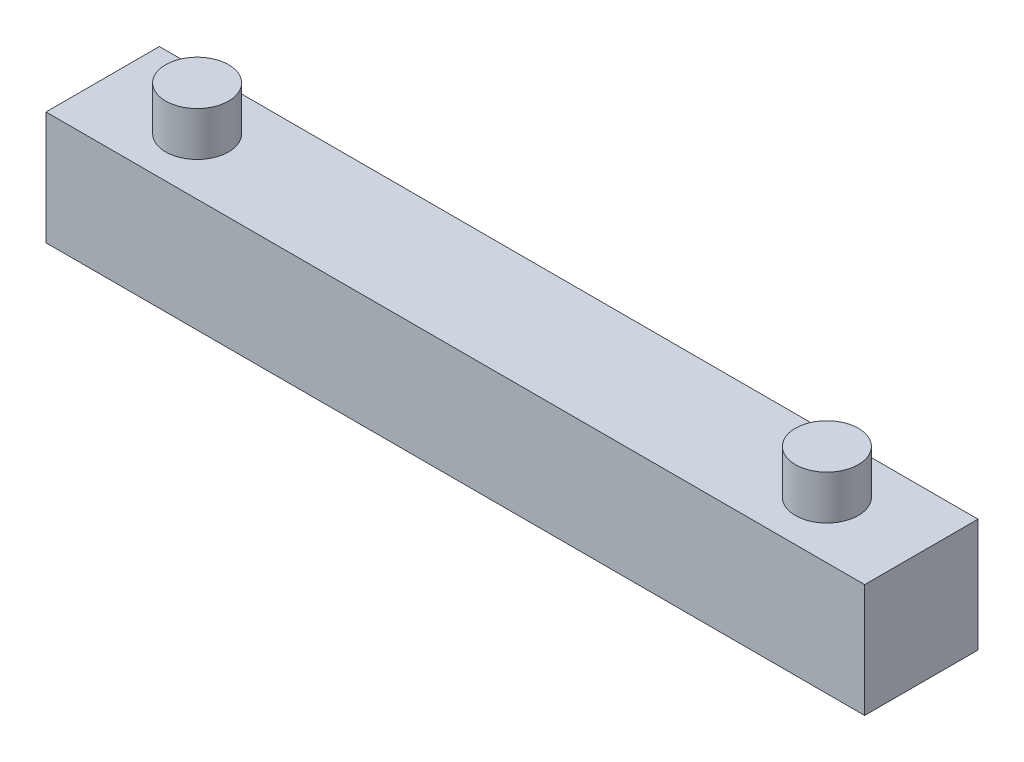
ISO-10303-21;
HEADER;
FILE_DESCRIPTION(('STEP AP214'),'2;1');
FILE_NAME('part.step','',(''),(''),'','','');
FILE_SCHEMA(('AUTOMOTIVE_DESIGN { 1 0 10303 214 1 1 1 1 }'));
ENDSEC;
DATA;
#1=APPLICATION_CONTEXT('core data for automotive mechanical design processes');
#2=APPLICATION_PROTOCOL_DEFINITION('international standard','automotive_design',2000,#1);
#3=PRODUCT_CONTEXT('',#1,'mechanical');
#4=PRODUCT('Part','Part','',(#3));
#5=PRODUCT_RELATED_PRODUCT_CATEGORY('part','',(#4));
#6=PRODUCT_DEFINITION_FORMATION('','',#4);
#7=PRODUCT_DEFINITION_CONTEXT('part definition',#1,'design');
#8=PRODUCT_DEFINITION('design','',#6,#7);
#9=PRODUCT_DEFINITION_SHAPE('','',#8);
#10=(LENGTH_UNIT() NAMED_UNIT(*) SI_UNIT(.MILLI.,.METRE.));
#11=(NAMED_UNIT(*) PLANE_ANGLE_UNIT() SI_UNIT($,.RADIAN.));
#12=(NAMED_UNIT(*) SI_UNIT($,.STERADIAN.) SOLID_ANGLE_UNIT());
#13=UNCERTAINTY_MEASURE_WITH_UNIT(LENGTH_MEASURE(1.E-05),#10,'distance_accuracy_value','');
#14=(GEOMETRIC_REPRESENTATION_CONTEXT(3) GLOBAL_UNCERTAINTY_ASSIGNED_CONTEXT((#13)) GLOBAL_UNIT_ASSIGNED_CONTEXT((#10,
#11,#12)) REPRESENTATION_CONTEXT('',''));
#15=CARTESIAN_POINT('',(0.,0.,0.));
#16=DIRECTION('',(0.,0.,1.));
#17=DIRECTION('',(1.,0.,0.));
#18=AXIS2_PLACEMENT_3D('',#15,#16,#17);
#19=CARTESIAN_POINT('',(-32.5,9.,-4.5));
#20=DIRECTION('',(1.,0.,0.));
#21=DIRECTION('',(0.,0.,-1.));
#22=AXIS2_PLACEMENT_3D('',#19,#20,#21);
#23=PLANE('',#22);
#24=DIRECTION('',(0.,0.,1.));
#25=VECTOR('',#24,1.);
#26=CARTESIAN_POINT('',(-32.5,0.,-4.5));
#27=LINE('',#26,#25);
#28=CARTESIAN_POINT('',(-32.5,0.,-4.5));
#29=VERTEX_POINT('',#28);
#30=CARTESIAN_POINT('',(-32.5,0.,4.5));
#31=VERTEX_POINT('',#30);
#32=EDGE_CURVE('E100',#29,#31,#27,.T.);
#33=ORIENTED_EDGE('',*,*,#32,.T.);
#34=DIRECTION('',(0.,-1.,0.));
#35=VECTOR('',#34,1.);
#36=CARTESIAN_POINT('',(-32.5,9.,4.5));
#37=LINE('',#36,#35);
#38=CARTESIAN_POINT('',(-32.5,9.,4.5));
#39=VERTEX_POINT('',#38);
#40=EDGE_CURVE('E91',#39,#31,#37,.T.);
#41=ORIENTED_EDGE('',*,*,#40,.F.);
#42=DIRECTION('',(0.,0.,1.));
#43=VECTOR('',#42,1.);
#44=CARTESIAN_POINT('',(-32.5,9.,-4.5));
#45=LINE('',#44,#43);
#46=CARTESIAN_POINT('',(-32.5,9.,-4.5));
#47=VERTEX_POINT('',#46);
#48=EDGE_CURVE('E85',#47,#39,#45,.T.);
#49=ORIENTED_EDGE('',*,*,#48,.F.);
#50=DIRECTION('',(0.,-1.,0.));
#51=VECTOR('',#50,1.);
#52=CARTESIAN_POINT('',(-32.5,9.,-4.5));
#53=LINE('',#52,#51);
#54=EDGE_CURVE('E96',#47,#29,#53,.T.);
#55=ORIENTED_EDGE('',*,*,#54,.T.);
#56=EDGE_LOOP('',(#33,#41,#49,#55));
#57=FACE_BOUND('',#56,.T.);
#58=ADVANCED_FACE('F33',(#57),#23,.F.);
#59=CARTESIAN_POINT('',(32.5,9.,4.49999999999999));
#60=DIRECTION('',(0.,0.,-1.));
#61=DIRECTION('',(-1.,0.,0.));
#62=AXIS2_PLACEMENT_3D('',#59,#60,#61);
#63=PLANE('',#62);
#64=DIRECTION('',(1.,0.,0.));
#65=VECTOR('',#64,1.);
#66=CARTESIAN_POINT('',(32.5,0.,4.49999999999999));
#67=LINE('',#66,#65);
#68=CARTESIAN_POINT('',(32.5,0.,4.49999999999999));
#69=VERTEX_POINT('',#68);
#70=EDGE_CURVE('E90',#31,#69,#67,.T.);
#71=ORIENTED_EDGE('',*,*,#70,.T.);
#72=DIRECTION('',(0.,-1.,0.));
#73=VECTOR('',#72,1.);
#74=CARTESIAN_POINT('',(32.5,9.,4.49999999999999));
#75=LINE('',#74,#73);
#76=CARTESIAN_POINT('',(32.5,9.,4.49999999999999));
#77=VERTEX_POINT('',#76);
#78=EDGE_CURVE('E88',#77,#69,#75,.T.);
#79=ORIENTED_EDGE('',*,*,#78,.F.);
#80=DIRECTION('',(1.,0.,0.));
#81=VECTOR('',#80,1.);
#82=CARTESIAN_POINT('',(32.5,9.,4.49999999999999));
#83=LINE('',#82,#81);
#84=EDGE_CURVE('E80',#39,#77,#83,.T.);
#85=ORIENTED_EDGE('',*,*,#84,.F.);
#86=ORIENTED_EDGE('',*,*,#40,.T.);
#87=EDGE_LOOP('',(#71,#79,#85,#86));
#88=FACE_BOUND('',#87,.T.);
#89=ADVANCED_FACE('F89',(#88),#63,.F.);
#90=CARTESIAN_POINT('',(32.5,9.,-4.5));
#91=DIRECTION('',(-1.,0.,0.));
#92=DIRECTION('',(0.,0.,1.));
#93=AXIS2_PLACEMENT_3D('',#90,#91,#92);
#94=PLANE('',#93);
#95=DIRECTION('',(0.,0.,-1.));
#96=VECTOR('',#95,1.);
#97=CARTESIAN_POINT('',(32.5,0.,-4.5));
#98=LINE('',#97,#96);
#99=CARTESIAN_POINT('',(32.5,0.,-4.5));
#100=VERTEX_POINT('',#99);
#101=EDGE_CURVE('E66',#69,#100,#98,.T.);
#102=ORIENTED_EDGE('',*,*,#101,.T.);
#103=DIRECTION('',(0.,-1.,0.));
#104=VECTOR('',#103,1.);
#105=CARTESIAN_POINT('',(32.5,9.,-4.5));
#106=LINE('',#105,#104);
#107=CARTESIAN_POINT('',(32.5,9.,-4.5));
#108=VERTEX_POINT('',#107);
#109=EDGE_CURVE('E92',#108,#100,#106,.T.);
#110=ORIENTED_EDGE('',*,*,#109,.F.);
#111=DIRECTION('',(0.,0.,-1.));
#112=VECTOR('',#111,1.);
#113=CARTESIAN_POINT('',(32.5,9.,-4.5));
#114=LINE('',#113,#112);
#115=EDGE_CURVE('E83',#77,#108,#114,.T.);
#116=ORIENTED_EDGE('',*,*,#115,.F.);
#117=ORIENTED_EDGE('',*,*,#78,.T.);
#118=EDGE_LOOP('',(#102,#110,#116,#117));
#119=FACE_BOUND('',#118,.T.);
#120=ADVANCED_FACE('F94',(#119),#94,.F.);
#121=CARTESIAN_POINT('',(32.5,9.,-4.5));
#122=DIRECTION('',(0.,0.,1.));
#123=DIRECTION('',(1.,0.,0.));
#124=AXIS2_PLACEMENT_3D('',#121,#122,#123);
#125=PLANE('',#124);
#126=DIRECTION('',(-1.,0.,0.));
#127=VECTOR('',#126,1.);
#128=CARTESIAN_POINT('',(32.5,0.,-4.5));
#129=LINE('',#128,#127);
#130=EDGE_CURVE('E72',#100,#29,#129,.T.);
#131=ORIENTED_EDGE('',*,*,#130,.T.);
#132=ORIENTED_EDGE('',*,*,#54,.F.);
#133=DIRECTION('',(-1.,0.,0.));
#134=VECTOR('',#133,1.);
#135=CARTESIAN_POINT('',(32.5,9.,-4.5));
#136=LINE('',#135,#134);
#137=EDGE_CURVE('E49',#108,#47,#136,.T.);
#138=ORIENTED_EDGE('',*,*,#137,.F.);
#139=ORIENTED_EDGE('',*,*,#109,.T.);
#140=EDGE_LOOP('',(#131,#132,#138,#139));
#141=FACE_BOUND('',#140,.T.);
#142=ADVANCED_FACE('F116',(#141),#125,.F.);
#143=CARTESIAN_POINT('',(0.,9.,0.));
#144=DIRECTION('',(0.,-1.,0.));
#145=DIRECTION('',(0.,0.,-1.));
#146=AXIS2_PLACEMENT_3D('',#143,#144,#145);
#147=PLANE('',#146);
#148=CARTESIAN_POINT('',(25.,9.,0.));
#149=DIRECTION('',(0.,-1.,0.));
#150=DIRECTION('',(0.,0.,-1.));
#151=AXIS2_PLACEMENT_3D('',#148,#149,#150);
#152=CIRCLE('',#151,2.5);
#153=CARTESIAN_POINT('',(25.,9.,-2.5));
#154=VERTEX_POINT('',#153);
#155=EDGE_CURVE('E11',#154,#154,#152,.F.);
#156=ORIENTED_EDGE('',*,*,#155,.F.);
#157=EDGE_LOOP('',(#156));
#158=FACE_BOUND('',#157,.T.);
#159=CARTESIAN_POINT('',(-25.,9.,0.));
#160=DIRECTION('',(0.,-1.,0.));
#161=DIRECTION('',(0.,0.,-1.));
#162=AXIS2_PLACEMENT_3D('',#159,#160,#161);
#163=CIRCLE('',#162,2.5);
#164=CARTESIAN_POINT('',(-25.,9.,-2.5));
#165=VERTEX_POINT('',#164);
#166=EDGE_CURVE('E41',#165,#165,#163,.F.);
#167=ORIENTED_EDGE('',*,*,#166,.F.);
#168=EDGE_LOOP('',(#167));
#169=FACE_BOUND('',#168,.T.);
#170=ORIENTED_EDGE('',*,*,#48,.T.);
#171=ORIENTED_EDGE('',*,*,#84,.T.);
#172=ORIENTED_EDGE('',*,*,#115,.T.);
#173=ORIENTED_EDGE('',*,*,#137,.T.);
#174=EDGE_LOOP('',(#170,#171,#172,#173));
#175=FACE_BOUND('',#174,.T.);
#176=ADVANCED_FACE('F81',(#158,#169,#175),#147,.F.);
#177=CARTESIAN_POINT('',(0.,0.,0.));
#178=DIRECTION('',(0.,-1.,0.));
#179=DIRECTION('',(0.,0.,-1.));
#180=AXIS2_PLACEMENT_3D('',#177,#178,#179);
#181=PLANE('',#180);
#182=ORIENTED_EDGE('',*,*,#32,.F.);
#183=ORIENTED_EDGE('',*,*,#130,.F.);
#184=ORIENTED_EDGE('',*,*,#101,.F.);
#185=ORIENTED_EDGE('',*,*,#70,.F.);
#186=EDGE_LOOP('',(#182,#183,#184,#185));
#187=FACE_BOUND('',#186,.T.);
#188=ADVANCED_FACE('F115',(#187),#181,.T.);
#189=CARTESIAN_POINT('',(-25.,12.5,0.));
#190=DIRECTION('',(0.,-1.,0.));
#191=DIRECTION('',(0.,0.,-1.));
#192=AXIS2_PLACEMENT_3D('',#189,#190,#191);
#193=CYLINDRICAL_SURFACE('',#192,2.5);
#194=CARTESIAN_POINT('',(-25.,12.5,0.));
#195=DIRECTION('',(0.,1.,0.));
#196=DIRECTION('',(0.,0.,1.));
#197=AXIS2_PLACEMENT_3D('',#194,#195,#196);
#198=CIRCLE('',#197,2.5);
#199=CARTESIAN_POINT('',(-25.,12.5,2.5));
#200=VERTEX_POINT('',#199);
#201=EDGE_CURVE('E103',#200,#200,#198,.T.);
#202=ORIENTED_EDGE('',*,*,#201,.F.);
#203=EDGE_LOOP('',(#202));
#204=FACE_BOUND('',#203,.T.);
#205=ORIENTED_EDGE('',*,*,#166,.T.);
#206=EDGE_LOOP('',(#205));
#207=FACE_BOUND('',#206,.T.);
#208=ADVANCED_FACE('F112',(#204,#207),#193,.T.);
#209=CARTESIAN_POINT('',(-25.,12.5,0.));
#210=DIRECTION('',(0.,1.,0.));
#211=DIRECTION('',(0.,0.,1.));
#212=AXIS2_PLACEMENT_3D('',#209,#210,#211);
#213=PLANE('',#212);
#214=ORIENTED_EDGE('',*,*,#201,.T.);
#215=EDGE_LOOP('',(#214));
#216=FACE_BOUND('',#215,.T.);
#217=ADVANCED_FACE('F146',(#216),#213,.T.);
#218=CARTESIAN_POINT('',(25.,12.5,0.));
#219=DIRECTION('',(0.,-1.,0.));
#220=DIRECTION('',(0.,0.,-1.));
#221=AXIS2_PLACEMENT_3D('',#218,#219,#220);
#222=CYLINDRICAL_SURFACE('',#221,2.5);
#223=CARTESIAN_POINT('',(25.,12.5,0.));
#224=DIRECTION('',(0.,1.,0.));
#225=DIRECTION('',(0.,0.,1.));
#226=AXIS2_PLACEMENT_3D('',#223,#224,#225);
#227=CIRCLE('',#226,2.5);
#228=CARTESIAN_POINT('',(25.,12.5,2.5));
#229=VERTEX_POINT('',#228);
#230=EDGE_CURVE('E137',#229,#229,#227,.T.);
#231=ORIENTED_EDGE('',*,*,#230,.F.);
#232=EDGE_LOOP('',(#231));
#233=FACE_BOUND('',#232,.T.);
#234=ORIENTED_EDGE('',*,*,#155,.T.);
#235=EDGE_LOOP('',(#234));
#236=FACE_BOUND('',#235,.T.);
#237=ADVANCED_FACE('F143',(#233,#236),#222,.T.);
#238=CARTESIAN_POINT('',(25.,12.5,0.));
#239=DIRECTION('',(0.,1.,0.));
#240=DIRECTION('',(0.,0.,1.));
#241=AXIS2_PLACEMENT_3D('',#238,#239,#240);
#242=PLANE('',#241);
#243=ORIENTED_EDGE('',*,*,#230,.T.);
#244=EDGE_LOOP('',(#243));
#245=FACE_BOUND('',#244,.T.);
#246=ADVANCED_FACE('F141',(#245),#242,.T.);
#247=CLOSED_SHELL('',(#58,#89,#120,#142,#176,#188,#208,#217,#237,#246));
#248=MANIFOLD_SOLID_BREP('B2',#247);
#249=ADVANCED_BREP_SHAPE_REPRESENTATION('',(#18,#248),#14);
#250=SHAPE_DEFINITION_REPRESENTATION(#9,#249);
ENDSEC;
END-ISO-10303-21;
